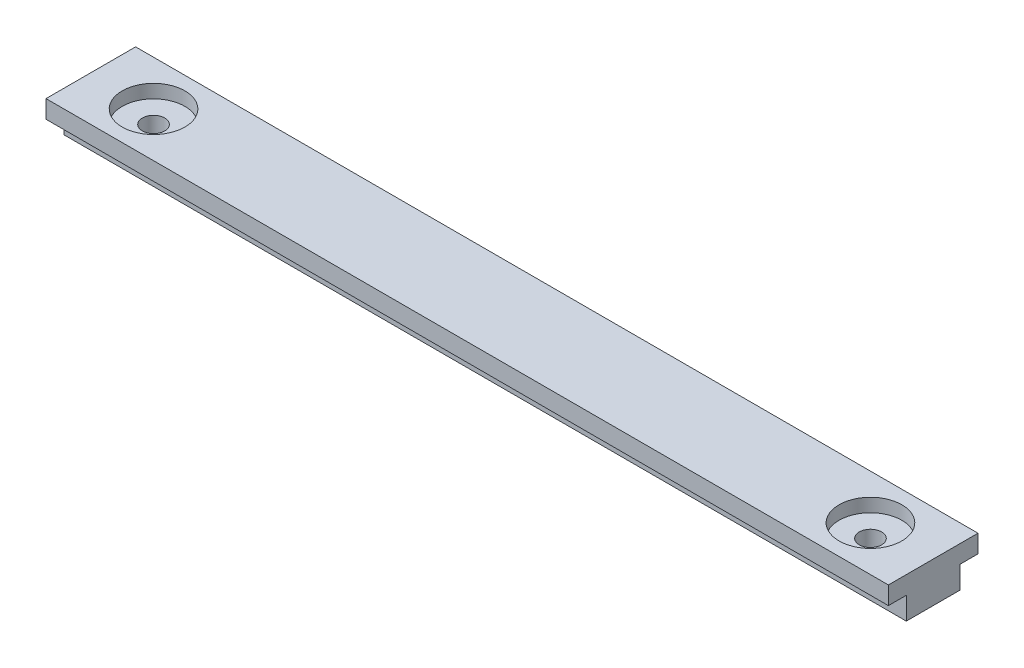
ISO-10303-21;
HEADER;
FILE_DESCRIPTION(('STEP AP214'),'2;1');
FILE_NAME('part.step','',(''),(''),'','','');
FILE_SCHEMA(('AUTOMOTIVE_DESIGN { 1 0 10303 214 1 1 1 1 }'));
ENDSEC;
DATA;
#1=APPLICATION_CONTEXT('core data for automotive mechanical design processes');
#2=APPLICATION_PROTOCOL_DEFINITION('international standard','automotive_design',2000,#1);
#3=PRODUCT_CONTEXT('',#1,'mechanical');
#4=PRODUCT('Part','Part','',(#3));
#5=PRODUCT_RELATED_PRODUCT_CATEGORY('part','',(#4));
#6=PRODUCT_DEFINITION_FORMATION('','',#4);
#7=PRODUCT_DEFINITION_CONTEXT('part definition',#1,'design');
#8=PRODUCT_DEFINITION('design','',#6,#7);
#9=PRODUCT_DEFINITION_SHAPE('','',#8);
#10=(LENGTH_UNIT() NAMED_UNIT(*) SI_UNIT(.MILLI.,.METRE.));
#11=(NAMED_UNIT(*) PLANE_ANGLE_UNIT() SI_UNIT($,.RADIAN.));
#12=(NAMED_UNIT(*) SI_UNIT($,.STERADIAN.) SOLID_ANGLE_UNIT());
#13=UNCERTAINTY_MEASURE_WITH_UNIT(LENGTH_MEASURE(1.E-05),#10,'distance_accuracy_value','');
#14=(GEOMETRIC_REPRESENTATION_CONTEXT(3) GLOBAL_UNCERTAINTY_ASSIGNED_CONTEXT((#13)) GLOBAL_UNIT_ASSIGNED_CONTEXT((#10,
#11,#12)) REPRESENTATION_CONTEXT('',''));
#15=CARTESIAN_POINT('',(0.,0.,0.));
#16=DIRECTION('',(0.,0.,1.));
#17=DIRECTION('',(1.,0.,0.));
#18=AXIS2_PLACEMENT_3D('',#15,#16,#17);
#19=CARTESIAN_POINT('',(-40.,-1.50000000000001,0.));
#20=DIRECTION('',(0.,-1.,0.));
#21=DIRECTION('',(1.,0.,0.));
#22=AXIS2_PLACEMENT_3D('',#19,#20,#21);
#23=CYLINDRICAL_SURFACE('',#22,1.25);
#24=CARTESIAN_POINT('',(-40.,-1.50000000000001,0.));
#25=DIRECTION('',(0.,1.,0.));
#26=DIRECTION('',(-1.,0.,0.));
#27=AXIS2_PLACEMENT_3D('',#24,#25,#26);
#28=CIRCLE('',#27,1.25);
#29=CARTESIAN_POINT('',(-41.25,-1.50000000000001,0.));
#30=VERTEX_POINT('',#29);
#31=EDGE_CURVE('E316',#30,#30,#28,.T.);
#32=ORIENTED_EDGE('',*,*,#31,.T.);
#33=EDGE_LOOP('',(#32));
#34=FACE_BOUND('',#33,.T.);
#35=CARTESIAN_POINT('',(-40.,-4.50000000000001,0.));
#36=DIRECTION('',(0.,1.,0.));
#37=DIRECTION('',(-1.,0.,0.));
#38=AXIS2_PLACEMENT_3D('',#35,#36,#37);
#39=CIRCLE('',#38,1.25);
#40=CARTESIAN_POINT('',(-41.25,-4.50000000000001,0.));
#41=VERTEX_POINT('',#40);
#42=EDGE_CURVE('E11',#41,#41,#39,.T.);
#43=ORIENTED_EDGE('',*,*,#42,.F.);
#44=EDGE_LOOP('',(#43));
#45=FACE_BOUND('',#44,.T.);
#46=ADVANCED_FACE('F35',(#34,#45),#23,.F.);
#47=CARTESIAN_POINT('',(-30.,-1.50000000000001,0.));
#48=DIRECTION('',(0.,1.,0.));
#49=DIRECTION('',(-1.,0.,0.));
#50=AXIS2_PLACEMENT_3D('',#47,#48,#49);
#51=PLANE('',#50);
#52=CARTESIAN_POINT('',(-30.,-1.50000000000001,0.));
#53=DIRECTION('',(0.,1.,0.));
#54=DIRECTION('',(-1.,0.,0.));
#55=AXIS2_PLACEMENT_3D('',#52,#53,#54);
#56=CIRCLE('',#55,1.25);
#57=CARTESIAN_POINT('',(-31.25,-1.50000000000001,0.));
#58=VERTEX_POINT('',#57);
#59=EDGE_CURVE('E42',#58,#58,#56,.T.);
#60=ORIENTED_EDGE('',*,*,#59,.F.);
#61=EDGE_LOOP('',(#60));
#62=FACE_BOUND('',#61,.T.);
#63=ADVANCED_FACE('F202',(#62),#51,.F.);
#64=CARTESIAN_POINT('',(-30.,-1.50000000000001,0.));
#65=DIRECTION('',(0.,-1.,0.));
#66=DIRECTION('',(1.,0.,0.));
#67=AXIS2_PLACEMENT_3D('',#64,#65,#66);
#68=CYLINDRICAL_SURFACE('',#67,1.25);
#69=ORIENTED_EDGE('',*,*,#59,.T.);
#70=EDGE_LOOP('',(#69));
#71=FACE_BOUND('',#70,.T.);
#72=CARTESIAN_POINT('',(-30.,-4.50000000000001,0.));
#73=DIRECTION('',(0.,1.,0.));
#74=DIRECTION('',(-1.,0.,0.));
#75=AXIS2_PLACEMENT_3D('',#72,#73,#74);
#76=CIRCLE('',#75,1.25);
#77=CARTESIAN_POINT('',(-31.25,-4.50000000000001,0.));
#78=VERTEX_POINT('',#77);
#79=EDGE_CURVE('E194',#78,#78,#76,.T.);
#80=ORIENTED_EDGE('',*,*,#79,.F.);
#81=EDGE_LOOP('',(#80));
#82=FACE_BOUND('',#81,.T.);
#83=ADVANCED_FACE('F199',(#71,#82),#68,.F.);
#84=CARTESIAN_POINT('',(-20.,-1.5,0.));
#85=DIRECTION('',(0.,1.,0.));
#86=DIRECTION('',(-1.,0.,0.));
#87=AXIS2_PLACEMENT_3D('',#84,#85,#86);
#88=PLANE('',#87);
#89=CARTESIAN_POINT('',(-20.,-1.5,0.));
#90=DIRECTION('',(0.,1.,0.));
#91=DIRECTION('',(-1.,0.,0.));
#92=AXIS2_PLACEMENT_3D('',#89,#90,#91);
#93=CIRCLE('',#92,1.25);
#94=CARTESIAN_POINT('',(-21.25,-1.5,0.));
#95=VERTEX_POINT('',#94);
#96=EDGE_CURVE('E191',#95,#95,#93,.T.);
#97=ORIENTED_EDGE('',*,*,#96,.F.);
#98=EDGE_LOOP('',(#97));
#99=FACE_BOUND('',#98,.T.);
#100=ADVANCED_FACE('F208',(#99),#88,.F.);
#101=CARTESIAN_POINT('',(-20.,-1.5,0.));
#102=DIRECTION('',(0.,-1.,0.));
#103=DIRECTION('',(1.,0.,0.));
#104=AXIS2_PLACEMENT_3D('',#101,#102,#103);
#105=CYLINDRICAL_SURFACE('',#104,1.25);
#106=ORIENTED_EDGE('',*,*,#96,.T.);
#107=EDGE_LOOP('',(#106));
#108=FACE_BOUND('',#107,.T.);
#109=CARTESIAN_POINT('',(-20.,-4.5,0.));
#110=DIRECTION('',(0.,1.,0.));
#111=DIRECTION('',(-1.,0.,0.));
#112=AXIS2_PLACEMENT_3D('',#109,#110,#111);
#113=CIRCLE('',#112,1.25);
#114=CARTESIAN_POINT('',(-21.25,-4.5,0.));
#115=VERTEX_POINT('',#114);
#116=EDGE_CURVE('E188',#115,#115,#113,.T.);
#117=ORIENTED_EDGE('',*,*,#116,.F.);
#118=EDGE_LOOP('',(#117));
#119=FACE_BOUND('',#118,.T.);
#120=ADVANCED_FACE('F214',(#108,#119),#105,.F.);
#121=CARTESIAN_POINT('',(-10.,-1.5,0.));
#122=DIRECTION('',(0.,1.,0.));
#123=DIRECTION('',(-1.,0.,0.));
#124=AXIS2_PLACEMENT_3D('',#121,#122,#123);
#125=PLANE('',#124);
#126=CARTESIAN_POINT('',(-10.,-1.5,0.));
#127=DIRECTION('',(0.,1.,0.));
#128=DIRECTION('',(-1.,0.,0.));
#129=AXIS2_PLACEMENT_3D('',#126,#127,#128);
#130=CIRCLE('',#129,1.25);
#131=CARTESIAN_POINT('',(-11.25,-1.5,0.));
#132=VERTEX_POINT('',#131);
#133=EDGE_CURVE('E185',#132,#132,#130,.T.);
#134=ORIENTED_EDGE('',*,*,#133,.F.);
#135=EDGE_LOOP('',(#134));
#136=FACE_BOUND('',#135,.T.);
#137=ADVANCED_FACE('F218',(#136),#125,.F.);
#138=CARTESIAN_POINT('',(-10.,-1.5,0.));
#139=DIRECTION('',(0.,-1.,0.));
#140=DIRECTION('',(1.,0.,0.));
#141=AXIS2_PLACEMENT_3D('',#138,#139,#140);
#142=CYLINDRICAL_SURFACE('',#141,1.25);
#143=ORIENTED_EDGE('',*,*,#133,.T.);
#144=EDGE_LOOP('',(#143));
#145=FACE_BOUND('',#144,.T.);
#146=CARTESIAN_POINT('',(-10.,-4.5,0.));
#147=DIRECTION('',(0.,1.,0.));
#148=DIRECTION('',(-1.,0.,0.));
#149=AXIS2_PLACEMENT_3D('',#146,#147,#148);
#150=CIRCLE('',#149,1.25);
#151=CARTESIAN_POINT('',(-11.25,-4.5,0.));
#152=VERTEX_POINT('',#151);
#153=EDGE_CURVE('E182',#152,#152,#150,.T.);
#154=ORIENTED_EDGE('',*,*,#153,.F.);
#155=EDGE_LOOP('',(#154));
#156=FACE_BOUND('',#155,.T.);
#157=ADVANCED_FACE('F222',(#145,#156),#142,.F.);
#158=CARTESIAN_POINT('',(0.,-1.5,0.));
#159=DIRECTION('',(0.,1.,0.));
#160=DIRECTION('',(-1.,0.,0.));
#161=AXIS2_PLACEMENT_3D('',#158,#159,#160);
#162=PLANE('',#161);
#163=CARTESIAN_POINT('',(0.,-1.5,0.));
#164=DIRECTION('',(0.,1.,0.));
#165=DIRECTION('',(-1.,0.,0.));
#166=AXIS2_PLACEMENT_3D('',#163,#164,#165);
#167=CIRCLE('',#166,1.25);
#168=CARTESIAN_POINT('',(-1.25,-1.5,0.));
#169=VERTEX_POINT('',#168);
#170=EDGE_CURVE('E179',#169,#169,#167,.T.);
#171=ORIENTED_EDGE('',*,*,#170,.F.);
#172=EDGE_LOOP('',(#171));
#173=FACE_BOUND('',#172,.T.);
#174=ADVANCED_FACE('F226',(#173),#162,.F.);
#175=CARTESIAN_POINT('',(0.,-1.5,0.));
#176=DIRECTION('',(0.,-1.,0.));
#177=DIRECTION('',(1.,0.,0.));
#178=AXIS2_PLACEMENT_3D('',#175,#176,#177);
#179=CYLINDRICAL_SURFACE('',#178,1.25);
#180=ORIENTED_EDGE('',*,*,#170,.T.);
#181=EDGE_LOOP('',(#180));
#182=FACE_BOUND('',#181,.T.);
#183=CARTESIAN_POINT('',(0.,-4.5,0.));
#184=DIRECTION('',(0.,1.,0.));
#185=DIRECTION('',(-1.,0.,0.));
#186=AXIS2_PLACEMENT_3D('',#183,#184,#185);
#187=CIRCLE('',#186,1.25);
#188=CARTESIAN_POINT('',(-1.25,-4.5,0.));
#189=VERTEX_POINT('',#188);
#190=EDGE_CURVE('E176',#189,#189,#187,.T.);
#191=ORIENTED_EDGE('',*,*,#190,.F.);
#192=EDGE_LOOP('',(#191));
#193=FACE_BOUND('',#192,.T.);
#194=ADVANCED_FACE('F230',(#182,#193),#179,.F.);
#195=CARTESIAN_POINT('',(10.,-1.49999999999999,0.));
#196=DIRECTION('',(0.,1.,0.));
#197=DIRECTION('',(-1.,0.,0.));
#198=AXIS2_PLACEMENT_3D('',#195,#196,#197);
#199=PLANE('',#198);
#200=CARTESIAN_POINT('',(10.,-1.49999999999999,0.));
#201=DIRECTION('',(0.,1.,0.));
#202=DIRECTION('',(-1.,0.,0.));
#203=AXIS2_PLACEMENT_3D('',#200,#201,#202);
#204=CIRCLE('',#203,1.25);
#205=CARTESIAN_POINT('',(8.75,-1.5,0.));
#206=VERTEX_POINT('',#205);
#207=EDGE_CURVE('E173',#206,#206,#204,.T.);
#208=ORIENTED_EDGE('',*,*,#207,.F.);
#209=EDGE_LOOP('',(#208));
#210=FACE_BOUND('',#209,.T.);
#211=ADVANCED_FACE('F234',(#210),#199,.F.);
#212=CARTESIAN_POINT('',(10.,-1.49999999999999,0.));
#213=DIRECTION('',(0.,-1.,0.));
#214=DIRECTION('',(1.,0.,0.));
#215=AXIS2_PLACEMENT_3D('',#212,#213,#214);
#216=CYLINDRICAL_SURFACE('',#215,1.25);
#217=ORIENTED_EDGE('',*,*,#207,.T.);
#218=EDGE_LOOP('',(#217));
#219=FACE_BOUND('',#218,.T.);
#220=CARTESIAN_POINT('',(10.,-4.5,0.));
#221=DIRECTION('',(0.,1.,0.));
#222=DIRECTION('',(-1.,0.,0.));
#223=AXIS2_PLACEMENT_3D('',#220,#221,#222);
#224=CIRCLE('',#223,1.25);
#225=CARTESIAN_POINT('',(8.75,-4.5,0.));
#226=VERTEX_POINT('',#225);
#227=EDGE_CURVE('E170',#226,#226,#224,.T.);
#228=ORIENTED_EDGE('',*,*,#227,.F.);
#229=EDGE_LOOP('',(#228));
#230=FACE_BOUND('',#229,.T.);
#231=ADVANCED_FACE('F238',(#219,#230),#216,.F.);
#232=CARTESIAN_POINT('',(20.,-1.49999999999999,0.));
#233=DIRECTION('',(0.,1.,0.));
#234=DIRECTION('',(-1.,0.,0.));
#235=AXIS2_PLACEMENT_3D('',#232,#233,#234);
#236=PLANE('',#235);
#237=CARTESIAN_POINT('',(20.,-1.49999999999999,0.));
#238=DIRECTION('',(0.,1.,0.));
#239=DIRECTION('',(-1.,0.,0.));
#240=AXIS2_PLACEMENT_3D('',#237,#238,#239);
#241=CIRCLE('',#240,1.25);
#242=CARTESIAN_POINT('',(18.75,-1.49999999999999,0.));
#243=VERTEX_POINT('',#242);
#244=EDGE_CURVE('E167',#243,#243,#241,.T.);
#245=ORIENTED_EDGE('',*,*,#244,.F.);
#246=EDGE_LOOP('',(#245));
#247=FACE_BOUND('',#246,.T.);
#248=ADVANCED_FACE('F242',(#247),#236,.F.);
#249=CARTESIAN_POINT('',(20.,-1.49999999999999,0.));
#250=DIRECTION('',(0.,-1.,0.));
#251=DIRECTION('',(1.,0.,0.));
#252=AXIS2_PLACEMENT_3D('',#249,#250,#251);
#253=CYLINDRICAL_SURFACE('',#252,1.25);
#254=ORIENTED_EDGE('',*,*,#244,.T.);
#255=EDGE_LOOP('',(#254));
#256=FACE_BOUND('',#255,.T.);
#257=CARTESIAN_POINT('',(20.,-4.49999999999999,0.));
#258=DIRECTION('',(0.,1.,0.));
#259=DIRECTION('',(-1.,0.,0.));
#260=AXIS2_PLACEMENT_3D('',#257,#258,#259);
#261=CIRCLE('',#260,1.25);
#262=CARTESIAN_POINT('',(18.75,-4.49999999999999,0.));
#263=VERTEX_POINT('',#262);
#264=EDGE_CURVE('E164',#263,#263,#261,.T.);
#265=ORIENTED_EDGE('',*,*,#264,.F.);
#266=EDGE_LOOP('',(#265));
#267=FACE_BOUND('',#266,.T.);
#268=ADVANCED_FACE('F246',(#256,#267),#253,.F.);
#269=CARTESIAN_POINT('',(47.,-4.49999999999998,5.));
#270=DIRECTION('',(0.,1.,0.));
#271=DIRECTION('',(-1.,0.,0.));
#272=AXIS2_PLACEMENT_3D('',#269,#270,#271);
#273=PLANE('',#272);
#274=CARTESIAN_POINT('',(30.,-4.49999999999999,0.));
#275=DIRECTION('',(0.,1.,0.));
#276=DIRECTION('',(-1.,0.,0.));
#277=AXIS2_PLACEMENT_3D('',#274,#275,#276);
#278=CIRCLE('',#277,1.25);
#279=CARTESIAN_POINT('',(28.75,-4.49999999999999,0.));
#280=VERTEX_POINT('',#279);
#281=EDGE_CURVE('E335',#280,#280,#278,.T.);
#282=ORIENTED_EDGE('',*,*,#281,.T.);
#283=EDGE_LOOP('',(#282));
#284=FACE_BOUND('',#283,.T.);
#285=CARTESIAN_POINT('',(40.,-4.49999999999999,0.));
#286=DIRECTION('',(0.,1.,0.));
#287=DIRECTION('',(-1.,0.,0.));
#288=AXIS2_PLACEMENT_3D('',#285,#286,#287);
#289=CIRCLE('',#288,1.25);
#290=CARTESIAN_POINT('',(38.75,-4.49999999999999,0.));
#291=VERTEX_POINT('',#290);
#292=EDGE_CURVE('E341',#291,#291,#289,.T.);
#293=ORIENTED_EDGE('',*,*,#292,.T.);
#294=EDGE_LOOP('',(#293));
#295=FACE_BOUND('',#294,.T.);
#296=DIRECTION('',(1.,0.,0.));
#297=VECTOR('',#296,1.);
#298=CARTESIAN_POINT('',(-47.,-4.49999999999999,-3.));
#299=LINE('',#298,#297);
#300=CARTESIAN_POINT('',(-47.,-4.49999999999999,-3.));
#301=VERTEX_POINT('',#300);
#302=CARTESIAN_POINT('',(47.,-4.49999999999997,-3.));
#303=VERTEX_POINT('',#302);
#304=EDGE_CURVE('E111',#301,#303,#299,.T.);
#305=ORIENTED_EDGE('',*,*,#304,.T.);
#306=DIRECTION('',(0.,0.,-1.));
#307=VECTOR('',#306,1.);
#308=CARTESIAN_POINT('',(47.,-4.49999999999998,5.));
#309=LINE('',#308,#307);
#310=CARTESIAN_POINT('',(47.,-4.49999999999997,3.));
#311=VERTEX_POINT('',#310);
#312=EDGE_CURVE('E150',#311,#303,#309,.T.);
#313=ORIENTED_EDGE('',*,*,#312,.F.);
#314=DIRECTION('',(1.,0.,0.));
#315=VECTOR('',#314,1.);
#316=CARTESIAN_POINT('',(-47.,-4.49999999999999,3.));
#317=LINE('',#316,#315);
#318=CARTESIAN_POINT('',(-47.,-4.49999999999999,3.));
#319=VERTEX_POINT('',#318);
#320=EDGE_CURVE('E130',#319,#311,#317,.T.);
#321=ORIENTED_EDGE('',*,*,#320,.F.);
#322=DIRECTION('',(0.,0.,-1.));
#323=VECTOR('',#322,1.);
#324=CARTESIAN_POINT('',(-47.,-4.50000000000001,5.));
#325=LINE('',#324,#323);
#326=EDGE_CURVE('E157',#319,#301,#325,.T.);
#327=ORIENTED_EDGE('',*,*,#326,.T.);
#328=EDGE_LOOP('',(#305,#313,#321,#327));
#329=FACE_BOUND('',#328,.T.);
#330=ORIENTED_EDGE('',*,*,#264,.T.);
#331=EDGE_LOOP('',(#330));
#332=FACE_BOUND('',#331,.T.);
#333=ORIENTED_EDGE('',*,*,#227,.T.);
#334=EDGE_LOOP('',(#333));
#335=FACE_BOUND('',#334,.T.);
#336=ORIENTED_EDGE('',*,*,#190,.T.);
#337=EDGE_LOOP('',(#336));
#338=FACE_BOUND('',#337,.T.);
#339=ORIENTED_EDGE('',*,*,#153,.T.);
#340=EDGE_LOOP('',(#339));
#341=FACE_BOUND('',#340,.T.);
#342=ORIENTED_EDGE('',*,*,#116,.T.);
#343=EDGE_LOOP('',(#342));
#344=FACE_BOUND('',#343,.T.);
#345=ORIENTED_EDGE('',*,*,#79,.T.);
#346=EDGE_LOOP('',(#345));
#347=FACE_BOUND('',#346,.T.);
#348=ORIENTED_EDGE('',*,*,#42,.T.);
#349=EDGE_LOOP('',(#348));
#350=FACE_BOUND('',#349,.T.);
#351=ADVANCED_FACE('F250',(#284,#295,#329,#332,#335,#338,#341,#344,#347,#350),#273,.F.);
#352=CARTESIAN_POINT('',(47.,0.,5.));
#353=DIRECTION('',(-1.,0.,0.));
#354=DIRECTION('',(0.,0.,1.));
#355=AXIS2_PLACEMENT_3D('',#352,#353,#354);
#356=PLANE('',#355);
#357=DIRECTION('',(0.,0.,-1.));
#358=VECTOR('',#357,1.);
#359=CARTESIAN_POINT('',(47.,-1.99999999999998,-3.));
#360=LINE('',#359,#358);
#361=CARTESIAN_POINT('',(47.,-1.99999999999998,-3.));
#362=VERTEX_POINT('',#361);
#363=CARTESIAN_POINT('',(47.,-1.99999999999998,-5.));
#364=VERTEX_POINT('',#363);
#365=EDGE_CURVE('E102',#362,#364,#360,.T.);
#366=ORIENTED_EDGE('',*,*,#365,.T.);
#367=DIRECTION('',(0.,1.,0.));
#368=VECTOR('',#367,1.);
#369=CARTESIAN_POINT('',(47.,0.,-5.));
#370=LINE('',#369,#368);
#371=CARTESIAN_POINT('',(47.,0.,-5.));
#372=VERTEX_POINT('',#371);
#373=EDGE_CURVE('E141',#364,#372,#370,.T.);
#374=ORIENTED_EDGE('',*,*,#373,.T.);
#375=DIRECTION('',(0.,0.,-1.));
#376=VECTOR('',#375,1.);
#377=CARTESIAN_POINT('',(47.,0.,5.));
#378=LINE('',#377,#376);
#379=CARTESIAN_POINT('',(47.,0.,5.));
#380=VERTEX_POINT('',#379);
#381=EDGE_CURVE('E161',#380,#372,#378,.T.);
#382=ORIENTED_EDGE('',*,*,#381,.F.);
#383=DIRECTION('',(0.,1.,0.));
#384=VECTOR('',#383,1.);
#385=CARTESIAN_POINT('',(47.,0.,5.));
#386=LINE('',#385,#384);
#387=CARTESIAN_POINT('',(47.,-1.99999999999998,5.));
#388=VERTEX_POINT('',#387);
#389=EDGE_CURVE('E143',#388,#380,#386,.T.);
#390=ORIENTED_EDGE('',*,*,#389,.F.);
#391=DIRECTION('',(0.,0.,1.));
#392=VECTOR('',#391,1.);
#393=CARTESIAN_POINT('',(47.,-1.99999999999998,3.));
#394=LINE('',#393,#392);
#395=CARTESIAN_POINT('',(47.,-1.99999999999998,3.));
#396=VERTEX_POINT('',#395);
#397=EDGE_CURVE('E57',#396,#388,#394,.T.);
#398=ORIENTED_EDGE('',*,*,#397,.F.);
#399=DIRECTION('',(0.,1.,0.));
#400=VECTOR('',#399,1.);
#401=CARTESIAN_POINT('',(47.,-4.49999999999997,3.));
#402=LINE('',#401,#400);
#403=EDGE_CURVE('E132',#311,#396,#402,.T.);
#404=ORIENTED_EDGE('',*,*,#403,.F.);
#405=ORIENTED_EDGE('',*,*,#312,.T.);
#406=DIRECTION('',(0.,1.,0.));
#407=VECTOR('',#406,1.);
#408=CARTESIAN_POINT('',(47.,-4.49999999999997,-3.));
#409=LINE('',#408,#407);
#410=EDGE_CURVE('E105',#303,#362,#409,.T.);
#411=ORIENTED_EDGE('',*,*,#410,.T.);
#412=EDGE_LOOP('',(#366,#374,#382,#390,#398,#404,#405,#411));
#413=FACE_BOUND('',#412,.T.);
#414=ADVANCED_FACE('F252',(#413),#356,.F.);
#415=CARTESIAN_POINT('',(-47.,0.,5.));
#416=DIRECTION('',(1.,0.,0.));
#417=DIRECTION('',(0.,0.,-1.));
#418=AXIS2_PLACEMENT_3D('',#415,#416,#417);
#419=PLANE('',#418);
#420=DIRECTION('',(0.,0.,-1.));
#421=VECTOR('',#420,1.);
#422=CARTESIAN_POINT('',(-47.,-2.,-3.));
#423=LINE('',#422,#421);
#424=CARTESIAN_POINT('',(-47.,-2.,-3.));
#425=VERTEX_POINT('',#424);
#426=CARTESIAN_POINT('',(-47.,-1.99999999999999,-5.));
#427=VERTEX_POINT('',#426);
#428=EDGE_CURVE('E49',#425,#427,#423,.T.);
#429=ORIENTED_EDGE('',*,*,#428,.F.);
#430=DIRECTION('',(0.,-1.,0.));
#431=VECTOR('',#430,1.);
#432=CARTESIAN_POINT('',(-47.,-2.,-3.));
#433=LINE('',#432,#431);
#434=EDGE_CURVE('E106',#425,#301,#433,.T.);
#435=ORIENTED_EDGE('',*,*,#434,.T.);
#436=ORIENTED_EDGE('',*,*,#326,.F.);
#437=DIRECTION('',(0.,-1.,0.));
#438=VECTOR('',#437,1.);
#439=CARTESIAN_POINT('',(-47.,-2.,3.));
#440=LINE('',#439,#438);
#441=CARTESIAN_POINT('',(-47.,-2.,3.));
#442=VERTEX_POINT('',#441);
#443=EDGE_CURVE('E128',#442,#319,#440,.T.);
#444=ORIENTED_EDGE('',*,*,#443,.F.);
#445=DIRECTION('',(0.,0.,1.));
#446=VECTOR('',#445,1.);
#447=CARTESIAN_POINT('',(-47.,-2.,3.));
#448=LINE('',#447,#446);
#449=CARTESIAN_POINT('',(-47.,-2.,5.));
#450=VERTEX_POINT('',#449);
#451=EDGE_CURVE('E138',#442,#450,#448,.T.);
#452=ORIENTED_EDGE('',*,*,#451,.T.);
#453=DIRECTION('',(0.,-1.,0.));
#454=VECTOR('',#453,1.);
#455=CARTESIAN_POINT('',(-47.,0.,5.));
#456=LINE('',#455,#454);
#457=CARTESIAN_POINT('',(-47.,0.,5.));
#458=VERTEX_POINT('',#457);
#459=EDGE_CURVE('E147',#458,#450,#456,.T.);
#460=ORIENTED_EDGE('',*,*,#459,.F.);
#461=DIRECTION('',(0.,0.,-1.));
#462=VECTOR('',#461,1.);
#463=CARTESIAN_POINT('',(-47.,0.,5.));
#464=LINE('',#463,#462);
#465=CARTESIAN_POINT('',(-47.,0.,-5.));
#466=VERTEX_POINT('',#465);
#467=EDGE_CURVE('E159',#458,#466,#464,.T.);
#468=ORIENTED_EDGE('',*,*,#467,.T.);
#469=DIRECTION('',(0.,-1.,0.));
#470=VECTOR('',#469,1.);
#471=CARTESIAN_POINT('',(-47.,0.,-5.));
#472=LINE('',#471,#470);
#473=EDGE_CURVE('E121',#466,#427,#472,.T.);
#474=ORIENTED_EDGE('',*,*,#473,.T.);
#475=EDGE_LOOP('',(#429,#435,#436,#444,#452,#460,#468,#474));
#476=FACE_BOUND('',#475,.T.);
#477=ADVANCED_FACE('F118',(#476),#419,.F.);
#478=CARTESIAN_POINT('',(0.,0.,-5.));
#479=DIRECTION('',(0.,0.,-1.));
#480=DIRECTION('',(-1.,0.,0.));
#481=AXIS2_PLACEMENT_3D('',#478,#479,#480);
#482=PLANE('',#481);
#483=ORIENTED_EDGE('',*,*,#373,.F.);
#484=DIRECTION('',(-1.,0.,0.));
#485=VECTOR('',#484,1.);
#486=CARTESIAN_POINT('',(47.,-1.99999999999998,-5.));
#487=LINE('',#486,#485);
#488=EDGE_CURVE('E115',#364,#427,#487,.T.);
#489=ORIENTED_EDGE('',*,*,#488,.T.);
#490=ORIENTED_EDGE('',*,*,#473,.F.);
#491=DIRECTION('',(-1.,0.,0.));
#492=VECTOR('',#491,1.);
#493=CARTESIAN_POINT('',(47.,0.,-5.));
#494=LINE('',#493,#492);
#495=EDGE_CURVE('E152',#372,#466,#494,.T.);
#496=ORIENTED_EDGE('',*,*,#495,.F.);
#497=EDGE_LOOP('',(#483,#489,#490,#496));
#498=FACE_BOUND('',#497,.T.);
#499=ADVANCED_FACE('F260',(#498),#482,.T.);
#500=CARTESIAN_POINT('',(47.,0.,5.));
#501=DIRECTION('',(0.,-1.,0.));
#502=DIRECTION('',(1.,0.,0.));
#503=AXIS2_PLACEMENT_3D('',#500,#501,#502);
#504=PLANE('',#503);
#505=CARTESIAN_POINT('',(-40.,0.,0.));
#506=DIRECTION('',(0.,1.,0.));
#507=DIRECTION('',(-1.,0.,0.));
#508=AXIS2_PLACEMENT_3D('',#505,#506,#507);
#509=CIRCLE('',#508,3.5);
#510=CARTESIAN_POINT('',(-43.5,0.,0.));
#511=VERTEX_POINT('',#510);
#512=EDGE_CURVE('E320',#511,#511,#509,.T.);
#513=ORIENTED_EDGE('',*,*,#512,.F.);
#514=EDGE_LOOP('',(#513));
#515=FACE_BOUND('',#514,.T.);
#516=CARTESIAN_POINT('',(40.,0.,0.));
#517=DIRECTION('',(0.,1.,0.));
#518=DIRECTION('',(-1.,0.,0.));
#519=AXIS2_PLACEMENT_3D('',#516,#517,#518);
#520=CIRCLE('',#519,3.5);
#521=CARTESIAN_POINT('',(36.5,0.,0.));
#522=VERTEX_POINT('',#521);
#523=EDGE_CURVE('E322',#522,#522,#520,.T.);
#524=ORIENTED_EDGE('',*,*,#523,.F.);
#525=EDGE_LOOP('',(#524));
#526=FACE_BOUND('',#525,.T.);
#527=ORIENTED_EDGE('',*,*,#495,.T.);
#528=ORIENTED_EDGE('',*,*,#467,.F.);
#529=DIRECTION('',(-1.,0.,0.));
#530=VECTOR('',#529,1.);
#531=CARTESIAN_POINT('',(47.,0.,5.));
#532=LINE('',#531,#530);
#533=EDGE_CURVE('E145',#380,#458,#532,.T.);
#534=ORIENTED_EDGE('',*,*,#533,.F.);
#535=ORIENTED_EDGE('',*,*,#381,.T.);
#536=EDGE_LOOP('',(#527,#528,#534,#535));
#537=FACE_BOUND('',#536,.T.);
#538=ADVANCED_FACE('F256',(#515,#526,#537),#504,.F.);
#539=CARTESIAN_POINT('',(0.,0.,5.));
#540=DIRECTION('',(0.,0.,-1.));
#541=DIRECTION('',(-1.,0.,0.));
#542=AXIS2_PLACEMENT_3D('',#539,#540,#541);
#543=PLANE('',#542);
#544=ORIENTED_EDGE('',*,*,#459,.T.);
#545=DIRECTION('',(-1.,0.,0.));
#546=VECTOR('',#545,1.);
#547=CARTESIAN_POINT('',(47.,-1.99999999999998,5.));
#548=LINE('',#547,#546);
#549=EDGE_CURVE('E123',#388,#450,#548,.T.);
#550=ORIENTED_EDGE('',*,*,#549,.F.);
#551=ORIENTED_EDGE('',*,*,#389,.T.);
#552=ORIENTED_EDGE('',*,*,#533,.T.);
#553=EDGE_LOOP('',(#544,#550,#551,#552));
#554=FACE_BOUND('',#553,.T.);
#555=ADVANCED_FACE('F259',(#554),#543,.F.);
#556=CARTESIAN_POINT('',(47.,-1.99999999999998,3.));
#557=DIRECTION('',(0.,1.,0.));
#558=DIRECTION('',(-1.,0.,0.));
#559=AXIS2_PLACEMENT_3D('',#556,#557,#558);
#560=PLANE('',#559);
#561=ORIENTED_EDGE('',*,*,#549,.T.);
#562=ORIENTED_EDGE('',*,*,#451,.F.);
#563=DIRECTION('',(-1.,0.,0.));
#564=VECTOR('',#563,1.);
#565=CARTESIAN_POINT('',(47.,-1.99999999999998,3.));
#566=LINE('',#565,#564);
#567=EDGE_CURVE('E134',#396,#442,#566,.T.);
#568=ORIENTED_EDGE('',*,*,#567,.F.);
#569=ORIENTED_EDGE('',*,*,#397,.T.);
#570=EDGE_LOOP('',(#561,#562,#568,#569));
#571=FACE_BOUND('',#570,.T.);
#572=ADVANCED_FACE('F272',(#571),#560,.F.);
#573=CARTESIAN_POINT('',(0.,0.,3.));
#574=DIRECTION('',(0.,0.,1.));
#575=DIRECTION('',(1.,0.,0.));
#576=AXIS2_PLACEMENT_3D('',#573,#574,#575);
#577=PLANE('',#576);
#578=ORIENTED_EDGE('',*,*,#443,.T.);
#579=ORIENTED_EDGE('',*,*,#320,.T.);
#580=ORIENTED_EDGE('',*,*,#403,.T.);
#581=ORIENTED_EDGE('',*,*,#567,.T.);
#582=EDGE_LOOP('',(#578,#579,#580,#581));
#583=FACE_BOUND('',#582,.T.);
#584=ADVANCED_FACE('F276',(#583),#577,.T.);
#585=CARTESIAN_POINT('',(47.,-1.99999999999998,-3.));
#586=DIRECTION('',(0.,-1.,0.));
#587=DIRECTION('',(1.,0.,0.));
#588=AXIS2_PLACEMENT_3D('',#585,#586,#587);
#589=PLANE('',#588);
#590=ORIENTED_EDGE('',*,*,#488,.F.);
#591=ORIENTED_EDGE('',*,*,#365,.F.);
#592=DIRECTION('',(-1.,0.,0.));
#593=VECTOR('',#592,1.);
#594=CARTESIAN_POINT('',(47.,-1.99999999999998,-3.));
#595=LINE('',#594,#593);
#596=EDGE_CURVE('E98',#362,#425,#595,.T.);
#597=ORIENTED_EDGE('',*,*,#596,.T.);
#598=ORIENTED_EDGE('',*,*,#428,.T.);
#599=EDGE_LOOP('',(#590,#591,#597,#598));
#600=FACE_BOUND('',#599,.T.);
#601=ADVANCED_FACE('F100',(#600),#589,.T.);
#602=CARTESIAN_POINT('',(0.,0.,-3.));
#603=DIRECTION('',(0.,0.,-1.));
#604=DIRECTION('',(1.,0.,0.));
#605=AXIS2_PLACEMENT_3D('',#602,#603,#604);
#606=PLANE('',#605);
#607=ORIENTED_EDGE('',*,*,#434,.F.);
#608=ORIENTED_EDGE('',*,*,#596,.F.);
#609=ORIENTED_EDGE('',*,*,#410,.F.);
#610=ORIENTED_EDGE('',*,*,#304,.F.);
#611=EDGE_LOOP('',(#607,#608,#609,#610));
#612=FACE_BOUND('',#611,.T.);
#613=ADVANCED_FACE('F109',(#612),#606,.T.);
#614=CARTESIAN_POINT('',(40.,-1.49999999999999,0.));
#615=DIRECTION('',(0.,-1.,0.));
#616=DIRECTION('',(1.,0.,0.));
#617=AXIS2_PLACEMENT_3D('',#614,#615,#616);
#618=CYLINDRICAL_SURFACE('',#617,1.25);
#619=CARTESIAN_POINT('',(40.,-1.49999999999999,0.));
#620=DIRECTION('',(0.,1.,0.));
#621=DIRECTION('',(-1.,0.,0.));
#622=AXIS2_PLACEMENT_3D('',#619,#620,#621);
#623=CIRCLE('',#622,1.25);
#624=CARTESIAN_POINT('',(38.75,-1.49999999999999,0.));
#625=VERTEX_POINT('',#624);
#626=EDGE_CURVE('E330',#625,#625,#623,.T.);
#627=ORIENTED_EDGE('',*,*,#626,.T.);
#628=EDGE_LOOP('',(#627));
#629=FACE_BOUND('',#628,.T.);
#630=ORIENTED_EDGE('',*,*,#292,.F.);
#631=EDGE_LOOP('',(#630));
#632=FACE_BOUND('',#631,.T.);
#633=ADVANCED_FACE('F284',(#629,#632),#618,.F.);
#634=CARTESIAN_POINT('',(30.,-1.49999999999999,0.));
#635=DIRECTION('',(0.,-1.,0.));
#636=DIRECTION('',(1.,0.,0.));
#637=AXIS2_PLACEMENT_3D('',#634,#635,#636);
#638=CYLINDRICAL_SURFACE('',#637,1.25);
#639=CARTESIAN_POINT('',(30.,-1.49999999999999,0.));
#640=DIRECTION('',(0.,1.,0.));
#641=DIRECTION('',(-1.,0.,0.));
#642=AXIS2_PLACEMENT_3D('',#639,#640,#641);
#643=CIRCLE('',#642,1.25);
#644=CARTESIAN_POINT('',(28.75,-1.49999999999999,0.));
#645=VERTEX_POINT('',#644);
#646=EDGE_CURVE('E338',#645,#645,#643,.T.);
#647=ORIENTED_EDGE('',*,*,#646,.T.);
#648=EDGE_LOOP('',(#647));
#649=FACE_BOUND('',#648,.T.);
#650=ORIENTED_EDGE('',*,*,#281,.F.);
#651=EDGE_LOOP('',(#650));
#652=FACE_BOUND('',#651,.T.);
#653=ADVANCED_FACE('F287',(#649,#652),#638,.F.);
#654=CARTESIAN_POINT('',(30.,-1.49999999999999,0.));
#655=DIRECTION('',(0.,1.,0.));
#656=DIRECTION('',(-1.,0.,0.));
#657=AXIS2_PLACEMENT_3D('',#654,#655,#656);
#658=PLANE('',#657);
#659=ORIENTED_EDGE('',*,*,#646,.F.);
#660=EDGE_LOOP('',(#659));
#661=FACE_BOUND('',#660,.T.);
#662=ADVANCED_FACE('F291',(#661),#658,.F.);
#663=CARTESIAN_POINT('',(40.,-1.49999999999999,0.));
#664=DIRECTION('',(0.,1.,0.));
#665=DIRECTION('',(-1.,0.,0.));
#666=AXIS2_PLACEMENT_3D('',#663,#664,#665);
#667=CYLINDRICAL_SURFACE('',#666,3.5);
#668=CARTESIAN_POINT('',(40.,-1.49999999999999,0.));
#669=DIRECTION('',(0.,1.,0.));
#670=DIRECTION('',(-1.,0.,0.));
#671=AXIS2_PLACEMENT_3D('',#668,#669,#670);
#672=CIRCLE('',#671,3.5);
#673=CARTESIAN_POINT('',(36.5,-1.49999999999999,0.));
#674=VERTEX_POINT('',#673);
#675=EDGE_CURVE('E327',#674,#674,#672,.T.);
#676=ORIENTED_EDGE('',*,*,#675,.F.);
#677=EDGE_LOOP('',(#676));
#678=FACE_BOUND('',#677,.T.);
#679=ORIENTED_EDGE('',*,*,#523,.T.);
#680=EDGE_LOOP('',(#679));
#681=FACE_BOUND('',#680,.T.);
#682=ADVANCED_FACE('F295',(#678,#681),#667,.F.);
#683=CARTESIAN_POINT('',(40.,-1.49999999999999,0.));
#684=DIRECTION('',(0.,1.,0.));
#685=DIRECTION('',(-1.,0.,0.));
#686=AXIS2_PLACEMENT_3D('',#683,#684,#685);
#687=PLANE('',#686);
#688=ORIENTED_EDGE('',*,*,#626,.F.);
#689=EDGE_LOOP('',(#688));
#690=FACE_BOUND('',#689,.T.);
#691=ORIENTED_EDGE('',*,*,#675,.T.);
#692=EDGE_LOOP('',(#691));
#693=FACE_BOUND('',#692,.T.);
#694=ADVANCED_FACE('F299',(#690,#693),#687,.T.);
#695=CARTESIAN_POINT('',(-40.,-1.50000000000001,0.));
#696=DIRECTION('',(0.,1.,0.));
#697=DIRECTION('',(-1.,0.,0.));
#698=AXIS2_PLACEMENT_3D('',#695,#696,#697);
#699=CYLINDRICAL_SURFACE('',#698,3.5);
#700=CARTESIAN_POINT('',(-40.,-1.50000000000001,0.));
#701=DIRECTION('',(0.,1.,0.));
#702=DIRECTION('',(-1.,0.,0.));
#703=AXIS2_PLACEMENT_3D('',#700,#701,#702);
#704=CIRCLE('',#703,3.5);
#705=CARTESIAN_POINT('',(-43.5,-1.50000000000001,0.));
#706=VERTEX_POINT('',#705);
#707=EDGE_CURVE('E319',#706,#706,#704,.T.);
#708=ORIENTED_EDGE('',*,*,#707,.F.);
#709=EDGE_LOOP('',(#708));
#710=FACE_BOUND('',#709,.T.);
#711=ORIENTED_EDGE('',*,*,#512,.T.);
#712=EDGE_LOOP('',(#711));
#713=FACE_BOUND('',#712,.T.);
#714=ADVANCED_FACE('F303',(#710,#713),#699,.F.);
#715=CARTESIAN_POINT('',(-40.,-1.50000000000001,0.));
#716=DIRECTION('',(0.,1.,0.));
#717=DIRECTION('',(-1.,0.,0.));
#718=AXIS2_PLACEMENT_3D('',#715,#716,#717);
#719=PLANE('',#718);
#720=ORIENTED_EDGE('',*,*,#31,.F.);
#721=EDGE_LOOP('',(#720));
#722=FACE_BOUND('',#721,.T.);
#723=ORIENTED_EDGE('',*,*,#707,.T.);
#724=EDGE_LOOP('',(#723));
#725=FACE_BOUND('',#724,.T.);
#726=ADVANCED_FACE('F307',(#722,#725),#719,.T.);
#727=CLOSED_SHELL('',(#46,#63,#83,#100,#120,#137,#157,#174,#194,#211,#231,#248,#268,#351,#414,
#477,#499,#538,#555,#572,#584,#601,#613,#633,#653,#662,#682,#694,#714,#726));
#728=MANIFOLD_SOLID_BREP('B2',#727);
#729=ADVANCED_BREP_SHAPE_REPRESENTATION('',(#18,#728),#14);
#730=SHAPE_DEFINITION_REPRESENTATION(#9,#729);
ENDSEC;
END-ISO-10303-21;
